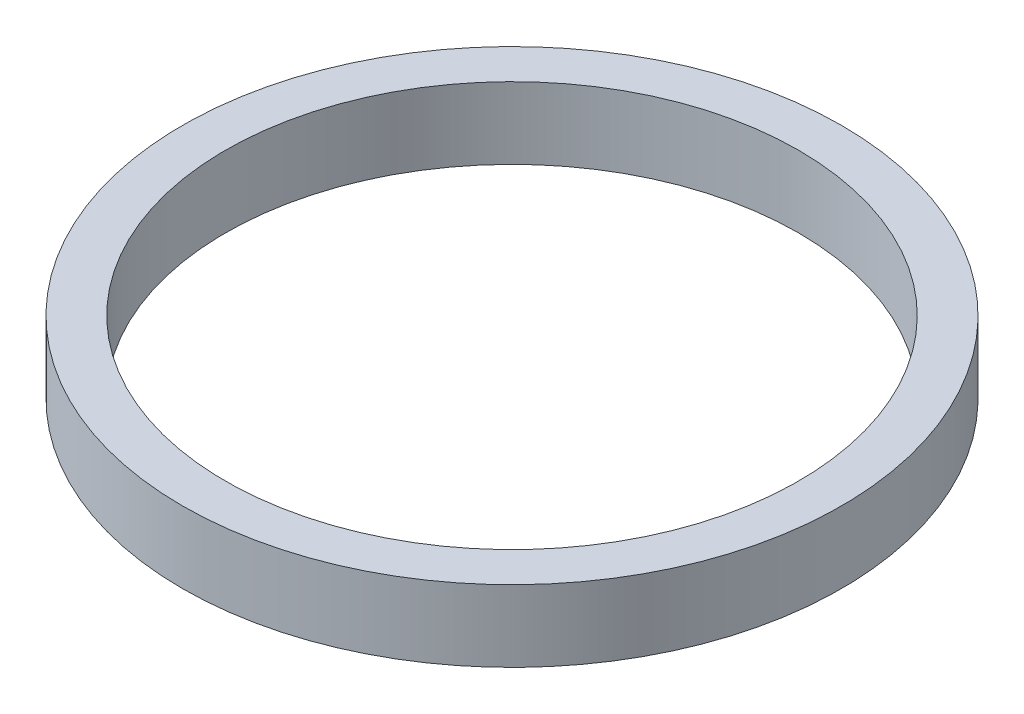
ISO-10303-21;
HEADER;
FILE_DESCRIPTION(('STEP AP214'),'2;1');
FILE_NAME('part.step','',(''),(''),'','','');
FILE_SCHEMA(('AUTOMOTIVE_DESIGN { 1 0 10303 214 1 1 1 1 }'));
ENDSEC;
DATA;
#1=APPLICATION_CONTEXT('core data for automotive mechanical design processes');
#2=APPLICATION_PROTOCOL_DEFINITION('international standard','automotive_design',2000,#1);
#3=PRODUCT_CONTEXT('',#1,'mechanical');
#4=PRODUCT('Part','Part','',(#3));
#5=PRODUCT_RELATED_PRODUCT_CATEGORY('part','',(#4));
#6=PRODUCT_DEFINITION_FORMATION('','',#4);
#7=PRODUCT_DEFINITION_CONTEXT('part definition',#1,'design');
#8=PRODUCT_DEFINITION('design','',#6,#7);
#9=PRODUCT_DEFINITION_SHAPE('','',#8);
#10=(LENGTH_UNIT() NAMED_UNIT(*) SI_UNIT(.MILLI.,.METRE.));
#11=(NAMED_UNIT(*) PLANE_ANGLE_UNIT() SI_UNIT($,.RADIAN.));
#12=(NAMED_UNIT(*) SI_UNIT($,.STERADIAN.) SOLID_ANGLE_UNIT());
#13=UNCERTAINTY_MEASURE_WITH_UNIT(LENGTH_MEASURE(1.E-05),#10,'distance_accuracy_value','');
#14=(GEOMETRIC_REPRESENTATION_CONTEXT(3) GLOBAL_UNCERTAINTY_ASSIGNED_CONTEXT((#13)) GLOBAL_UNIT_ASSIGNED_CONTEXT((#10,
#11,#12)) REPRESENTATION_CONTEXT('',''));
#15=CARTESIAN_POINT('',(0.,0.,0.));
#16=DIRECTION('',(0.,0.,1.));
#17=DIRECTION('',(1.,0.,0.));
#18=AXIS2_PLACEMENT_3D('',#15,#16,#17);
#19=CARTESIAN_POINT('',(11.5,0.,0.));
#20=DIRECTION('',(0.,-1.,0.));
#21=DIRECTION('',(0.,0.,-1.));
#22=AXIS2_PLACEMENT_3D('',#19,#20,#21);
#23=PLANE('',#22);
#24=CARTESIAN_POINT('',(0.,0.,0.));
#25=DIRECTION('',(0.,-1.,0.));
#26=DIRECTION('',(0.,0.,-1.));
#27=AXIS2_PLACEMENT_3D('',#24,#25,#26);
#28=CIRCLE('',#27,11.5);
#29=CARTESIAN_POINT('',(0.,0.,-11.5));
#30=VERTEX_POINT('',#29);
#31=EDGE_CURVE('E44',#30,#30,#28,.T.);
#32=ORIENTED_EDGE('',*,*,#31,.T.);
#33=EDGE_LOOP('',(#32));
#34=FACE_BOUND('',#33,.T.);
#35=CARTESIAN_POINT('',(0.,0.,0.));
#36=DIRECTION('',(0.,-1.,0.));
#37=DIRECTION('',(0.,0.,-1.));
#38=AXIS2_PLACEMENT_3D('',#35,#36,#37);
#39=CIRCLE('',#38,10.);
#40=CARTESIAN_POINT('',(0.,0.,-10.));
#41=VERTEX_POINT('',#40);
#42=EDGE_CURVE('E10',#41,#41,#39,.T.);
#43=ORIENTED_EDGE('',*,*,#42,.F.);
#44=EDGE_LOOP('',(#43));
#45=FACE_BOUND('',#44,.T.);
#46=ADVANCED_FACE('F30',(#34,#45),#23,.T.);
#47=CARTESIAN_POINT('',(0.,0.,0.));
#48=DIRECTION('',(0.,-1.,0.));
#49=DIRECTION('',(0.,0.,-1.));
#50=AXIS2_PLACEMENT_3D('',#47,#48,#49);
#51=CYLINDRICAL_SURFACE('',#50,10.);
#52=ORIENTED_EDGE('',*,*,#42,.T.);
#53=EDGE_LOOP('',(#52));
#54=FACE_BOUND('',#53,.T.);
#55=CARTESIAN_POINT('',(0.,2.5,0.));
#56=DIRECTION('',(0.,-1.,0.));
#57=DIRECTION('',(0.,0.,-1.));
#58=AXIS2_PLACEMENT_3D('',#55,#56,#57);
#59=CIRCLE('',#58,10.);
#60=CARTESIAN_POINT('',(0.,2.5,-10.));
#61=VERTEX_POINT('',#60);
#62=EDGE_CURVE('E36',#61,#61,#59,.T.);
#63=ORIENTED_EDGE('',*,*,#62,.F.);
#64=EDGE_LOOP('',(#63));
#65=FACE_BOUND('',#64,.T.);
#66=ADVANCED_FACE('F60',(#54,#65),#51,.F.);
#67=CARTESIAN_POINT('',(10.,2.5,0.));
#68=DIRECTION('',(0.,1.,0.));
#69=DIRECTION('',(0.,0.,1.));
#70=AXIS2_PLACEMENT_3D('',#67,#68,#69);
#71=PLANE('',#70);
#72=ORIENTED_EDGE('',*,*,#62,.T.);
#73=EDGE_LOOP('',(#72));
#74=FACE_BOUND('',#73,.T.);
#75=CARTESIAN_POINT('',(0.,2.5,0.));
#76=DIRECTION('',(0.,-1.,0.));
#77=DIRECTION('',(0.,0.,-1.));
#78=AXIS2_PLACEMENT_3D('',#75,#76,#77);
#79=CIRCLE('',#78,11.5);
#80=CARTESIAN_POINT('',(0.,2.5,-11.5));
#81=VERTEX_POINT('',#80);
#82=EDGE_CURVE('E40',#81,#81,#79,.T.);
#83=ORIENTED_EDGE('',*,*,#82,.F.);
#84=EDGE_LOOP('',(#83));
#85=FACE_BOUND('',#84,.T.);
#86=ADVANCED_FACE('F54',(#74,#85),#71,.T.);
#87=CARTESIAN_POINT('',(0.,0.,0.));
#88=DIRECTION('',(0.,-1.,0.));
#89=DIRECTION('',(0.,0.,-1.));
#90=AXIS2_PLACEMENT_3D('',#87,#88,#89);
#91=CYLINDRICAL_SURFACE('',#90,11.5);
#92=ORIENTED_EDGE('',*,*,#82,.T.);
#93=EDGE_LOOP('',(#92));
#94=FACE_BOUND('',#93,.T.);
#95=ORIENTED_EDGE('',*,*,#31,.F.);
#96=EDGE_LOOP('',(#95));
#97=FACE_BOUND('',#96,.T.);
#98=ADVANCED_FACE('F52',(#94,#97),#91,.T.);
#99=CLOSED_SHELL('',(#46,#66,#86,#98));
#100=MANIFOLD_SOLID_BREP('B2',#99);
#101=ADVANCED_BREP_SHAPE_REPRESENTATION('',(#18,#100),#14);
#102=SHAPE_DEFINITION_REPRESENTATION(#9,#101);
ENDSEC;
END-ISO-10303-21;
